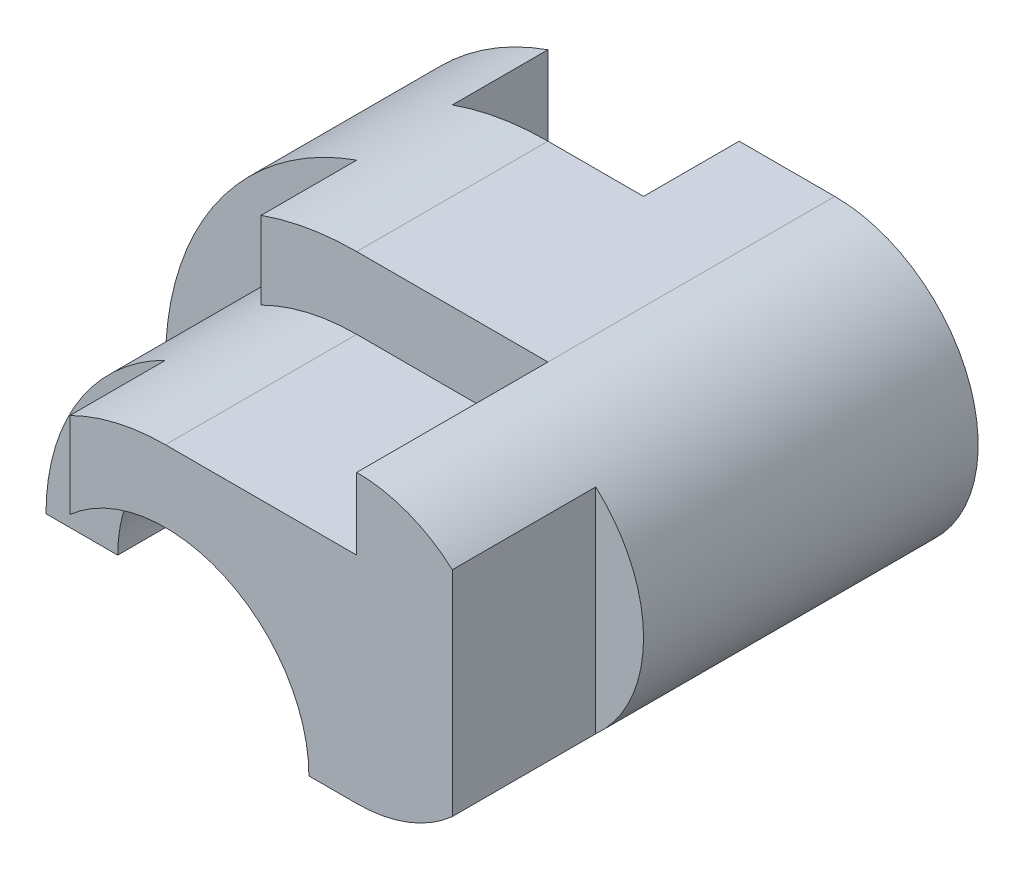
ISO-10303-21;
HEADER;
FILE_DESCRIPTION(('STEP AP214'),'2;1');
FILE_NAME('part.step','',(''),(''),'','','');
FILE_SCHEMA(('AUTOMOTIVE_DESIGN { 1 0 10303 214 1 1 1 1 }'));
ENDSEC;
DATA;
#1=APPLICATION_CONTEXT('core data for automotive mechanical design processes');
#2=APPLICATION_PROTOCOL_DEFINITION('international standard','automotive_design',2000,#1);
#3=PRODUCT_CONTEXT('',#1,'mechanical');
#4=PRODUCT('Part','Part','',(#3));
#5=PRODUCT_RELATED_PRODUCT_CATEGORY('part','',(#4));
#6=PRODUCT_DEFINITION_FORMATION('','',#4);
#7=PRODUCT_DEFINITION_CONTEXT('part definition',#1,'design');
#8=PRODUCT_DEFINITION('design','',#6,#7);
#9=PRODUCT_DEFINITION_SHAPE('','',#8);
#10=(LENGTH_UNIT() NAMED_UNIT(*) SI_UNIT(.MILLI.,.METRE.));
#11=(NAMED_UNIT(*) PLANE_ANGLE_UNIT() SI_UNIT($,.RADIAN.));
#12=(NAMED_UNIT(*) SI_UNIT($,.STERADIAN.) SOLID_ANGLE_UNIT());
#13=UNCERTAINTY_MEASURE_WITH_UNIT(LENGTH_MEASURE(1.E-05),#10,'distance_accuracy_value','');
#14=(GEOMETRIC_REPRESENTATION_CONTEXT(3) GLOBAL_UNCERTAINTY_ASSIGNED_CONTEXT((#13)) GLOBAL_UNIT_ASSIGNED_CONTEXT((#10,
#11,#12)) REPRESENTATION_CONTEXT('',''));
#15=CARTESIAN_POINT('',(0.,0.,0.));
#16=DIRECTION('',(0.,0.,1.));
#17=DIRECTION('',(1.,0.,0.));
#18=AXIS2_PLACEMENT_3D('',#15,#16,#17);
#19=CARTESIAN_POINT('',(20.,-61.999,20.));
#20=DIRECTION('',(0.,0.,1.));
#21=DIRECTION('',(1.,0.,0.));
#22=AXIS2_PLACEMENT_3D('',#19,#20,#21);
#23=PLANE('',#22);
#24=CARTESIAN_POINT('',(0.,0.,20.));
#25=DIRECTION('',(0.,0.,1.));
#26=DIRECTION('',(1.,0.,0.));
#27=AXIS2_PLACEMENT_3D('',#24,#25,#26);
#28=CIRCLE('',#27,30.);
#29=CARTESIAN_POINT('',(20.,22.3606797749979,20.));
#30=VERTEX_POINT('',#29);
#31=CARTESIAN_POINT('',(-20.,22.3606797749979,20.));
#32=VERTEX_POINT('',#31);
#33=EDGE_CURVE('E11',#30,#32,#28,.T.);
#34=ORIENTED_EDGE('',*,*,#33,.T.);
#35=DIRECTION('',(0.,1.,0.));
#36=VECTOR('',#35,1.);
#37=CARTESIAN_POINT('',(-20.,-61.999,20.));
#38=LINE('',#37,#36);
#39=CARTESIAN_POINT('',(-20.,56.5685424949238,20.));
#40=VERTEX_POINT('',#39);
#41=EDGE_CURVE('E171',#32,#40,#38,.T.);
#42=ORIENTED_EDGE('',*,*,#41,.T.);
#43=CARTESIAN_POINT('',(0.,0.,20.));
#44=DIRECTION('',(0.,0.,1.));
#45=DIRECTION('',(1.,0.,0.));
#46=AXIS2_PLACEMENT_3D('',#43,#44,#45);
#47=CIRCLE('',#46,60.);
#48=CARTESIAN_POINT('',(0.,60.,20.));
#49=VERTEX_POINT('',#48);
#50=EDGE_CURVE('E198',#40,#49,#47,.F.);
#51=ORIENTED_EDGE('',*,*,#50,.T.);
#52=DIRECTION('',(1.,0.,0.));
#53=VECTOR('',#52,1.);
#54=CARTESIAN_POINT('',(20.,60.,20.));
#55=LINE('',#54,#53);
#56=CARTESIAN_POINT('',(20.,60.,20.));
#57=VERTEX_POINT('',#56);
#58=EDGE_CURVE('E181',#49,#57,#55,.T.);
#59=ORIENTED_EDGE('',*,*,#58,.T.);
#60=DIRECTION('',(0.,1.,0.));
#61=VECTOR('',#60,1.);
#62=CARTESIAN_POINT('',(20.,-61.999,20.));
#63=LINE('',#62,#61);
#64=EDGE_CURVE('E180',#30,#57,#63,.T.);
#65=ORIENTED_EDGE('',*,*,#64,.F.);
#66=EDGE_LOOP('',(#34,#42,#51,#59,#65));
#67=FACE_BOUND('',#66,.T.);
#68=ADVANCED_FACE('F35',(#67),#23,.F.);
#69=CARTESIAN_POINT('',(0.,0.,0.));
#70=DIRECTION('',(0.,0.,1.));
#71=DIRECTION('',(1.,0.,0.));
#72=AXIS2_PLACEMENT_3D('',#69,#70,#71);
#73=PLANE('',#72);
#74=DIRECTION('',(0.,-1.,0.));
#75=VECTOR('',#74,1.);
#76=CARTESIAN_POINT('',(-20.,0.,0.));
#77=LINE('',#76,#75);
#78=CARTESIAN_POINT('',(-20.,56.5685424949238,0.));
#79=VERTEX_POINT('',#78);
#80=CARTESIAN_POINT('',(-20.,22.3606797749979,0.));
#81=VERTEX_POINT('',#80);
#82=EDGE_CURVE('E295',#79,#81,#77,.T.);
#83=ORIENTED_EDGE('',*,*,#82,.T.);
#84=CARTESIAN_POINT('',(0.,0.,0.));
#85=DIRECTION('',(0.,0.,1.));
#86=DIRECTION('',(1.,0.,0.));
#87=AXIS2_PLACEMENT_3D('',#84,#85,#86);
#88=CIRCLE('',#87,30.);
#89=CARTESIAN_POINT('',(-30.,0.,0.));
#90=VERTEX_POINT('',#89);
#91=EDGE_CURVE('E191',#81,#90,#88,.T.);
#92=ORIENTED_EDGE('',*,*,#91,.T.);
#93=DIRECTION('',(1.,0.,0.));
#94=VECTOR('',#93,1.);
#95=CARTESIAN_POINT('',(0.,0.,0.));
#96=LINE('',#95,#94);
#97=CARTESIAN_POINT('',(-60.,0.,0.));
#98=VERTEX_POINT('',#97);
#99=EDGE_CURVE('E263',#98,#90,#96,.T.);
#100=ORIENTED_EDGE('',*,*,#99,.F.);
#101=CARTESIAN_POINT('',(0.,0.,0.));
#102=DIRECTION('',(0.,0.,1.));
#103=DIRECTION('',(1.,0.,0.));
#104=AXIS2_PLACEMENT_3D('',#101,#102,#103);
#105=CIRCLE('',#104,60.);
#106=EDGE_CURVE('E248',#98,#79,#105,.F.);
#107=ORIENTED_EDGE('',*,*,#106,.T.);
#108=EDGE_LOOP('',(#83,#92,#100,#107));
#109=FACE_BOUND('',#108,.T.);
#110=ADVANCED_FACE('F378',(#109),#73,.F.);
#111=CARTESIAN_POINT('',(-20.,-61.999,0.));
#112=DIRECTION('',(-1.,0.,0.));
#113=DIRECTION('',(0.,0.,1.));
#114=AXIS2_PLACEMENT_3D('',#111,#112,#113);
#115=PLANE('',#114);
#116=ORIENTED_EDGE('',*,*,#41,.F.);
#117=DIRECTION('',(0.,0.,-1.));
#118=VECTOR('',#117,1.);
#119=CARTESIAN_POINT('',(-20.,22.3606797749979,100.));
#120=LINE('',#119,#118);
#121=EDGE_CURVE('E174',#32,#81,#120,.T.);
#122=ORIENTED_EDGE('',*,*,#121,.T.);
#123=ORIENTED_EDGE('',*,*,#82,.F.);
#124=DIRECTION('',(0.,0.,-1.));
#125=VECTOR('',#124,1.);
#126=CARTESIAN_POINT('',(-20.,56.5685424949238,100.));
#127=LINE('',#126,#125);
#128=EDGE_CURVE('E176',#79,#40,#127,.F.);
#129=ORIENTED_EDGE('',*,*,#128,.T.);
#130=EDGE_LOOP('',(#116,#122,#123,#129));
#131=FACE_BOUND('',#130,.T.);
#132=ADVANCED_FACE('F172',(#131),#115,.F.);
#133=CARTESIAN_POINT('',(30.,0.,0.));
#134=VERTEX_POINT('',#133);
#135=CARTESIAN_POINT('',(20.,22.3606797749979,0.));
#136=VERTEX_POINT('',#135);
#137=EDGE_CURVE('E266',#134,#136,#88,.T.);
#138=ORIENTED_EDGE('',*,*,#137,.T.);
#139=DIRECTION('',(0.,1.,0.));
#140=VECTOR('',#139,1.);
#141=CARTESIAN_POINT('',(20.,0.,0.));
#142=LINE('',#141,#140);
#143=CARTESIAN_POINT('',(20.,60.,0.));
#144=VERTEX_POINT('',#143);
#145=EDGE_CURVE('E43',#136,#144,#142,.T.);
#146=ORIENTED_EDGE('',*,*,#145,.T.);
#147=DIRECTION('',(1.,0.,0.));
#148=VECTOR('',#147,1.);
#149=CARTESIAN_POINT('',(0.,60.,0.));
#150=LINE('',#149,#148);
#151=CARTESIAN_POINT('',(40.,60.,0.));
#152=VERTEX_POINT('',#151);
#153=EDGE_CURVE('E253',#144,#152,#150,.T.);
#154=ORIENTED_EDGE('',*,*,#153,.T.);
#155=CARTESIAN_POINT('',(40.,30.,0.));
#156=DIRECTION('',(0.,0.,1.));
#157=DIRECTION('',(1.,0.,0.));
#158=AXIS2_PLACEMENT_3D('',#155,#156,#157);
#159=CIRCLE('',#158,30.);
#160=CARTESIAN_POINT('',(40.,0.,0.));
#161=VERTEX_POINT('',#160);
#162=EDGE_CURVE('E272',#152,#161,#159,.F.);
#163=ORIENTED_EDGE('',*,*,#162,.T.);
#164=DIRECTION('',(-1.,0.,0.));
#165=VECTOR('',#164,1.);
#166=CARTESIAN_POINT('',(0.,0.,0.));
#167=LINE('',#166,#165);
#168=EDGE_CURVE('E269',#161,#134,#167,.T.);
#169=ORIENTED_EDGE('',*,*,#168,.T.);
#170=EDGE_LOOP('',(#138,#146,#154,#163,#169));
#171=FACE_BOUND('',#170,.T.);
#172=ADVANCED_FACE('F299',(#171),#73,.F.);
#173=CARTESIAN_POINT('',(0.,0.,100.));
#174=DIRECTION('',(0.,0.,-1.));
#175=DIRECTION('',(-1.,0.,0.));
#176=AXIS2_PLACEMENT_3D('',#173,#174,#175);
#177=CYLINDRICAL_SURFACE('',#176,60.);
#178=CARTESIAN_POINT('',(0.,0.,40.));
#179=DIRECTION('',(0.,0.,1.));
#180=DIRECTION('',(1.,0.,0.));
#181=AXIS2_PLACEMENT_3D('',#178,#179,#180);
#182=CIRCLE('',#181,60.);
#183=CARTESIAN_POINT('',(-60.,0.,40.));
#184=VERTEX_POINT('',#183);
#185=CARTESIAN_POINT('',(-20.,56.5685424949238,40.));
#186=VERTEX_POINT('',#185);
#187=EDGE_CURVE('E238',#184,#186,#182,.F.);
#188=ORIENTED_EDGE('',*,*,#187,.T.);
#189=DIRECTION('',(0.,0.,1.));
#190=VECTOR('',#189,1.);
#191=CARTESIAN_POINT('',(-20.,56.5685424949238,31.001));
#192=LINE('',#191,#190);
#193=CARTESIAN_POINT('',(-20.,56.5685424949238,60.));
#194=VERTEX_POINT('',#193);
#195=EDGE_CURVE('E330',#186,#194,#192,.T.);
#196=ORIENTED_EDGE('',*,*,#195,.T.);
#197=CARTESIAN_POINT('',(0.,0.,60.));
#198=DIRECTION('',(0.,0.,1.));
#199=DIRECTION('',(1.,0.,0.));
#200=AXIS2_PLACEMENT_3D('',#197,#198,#199);
#201=CIRCLE('',#200,60.);
#202=CARTESIAN_POINT('',(0.,60.,60.));
#203=VERTEX_POINT('',#202);
#204=EDGE_CURVE('E336',#203,#194,#201,.T.);
#205=ORIENTED_EDGE('',*,*,#204,.F.);
#206=DIRECTION('',(0.,0.,-1.));
#207=VECTOR('',#206,1.);
#208=CARTESIAN_POINT('',(0.,60.,100.));
#209=LINE('',#208,#207);
#210=EDGE_CURVE('E260',#203,#49,#209,.T.);
#211=ORIENTED_EDGE('',*,*,#210,.T.);
#212=ORIENTED_EDGE('',*,*,#50,.F.);
#213=ORIENTED_EDGE('',*,*,#128,.F.);
#214=ORIENTED_EDGE('',*,*,#106,.F.);
#215=DIRECTION('',(0.,0.,-1.));
#216=VECTOR('',#215,1.);
#217=CARTESIAN_POINT('',(-60.,0.,100.));
#218=LINE('',#217,#216);
#219=EDGE_CURVE('E286',#184,#98,#218,.T.);
#220=ORIENTED_EDGE('',*,*,#219,.F.);
#221=EDGE_LOOP('',(#188,#196,#205,#211,#212,#213,#214,#220));
#222=FACE_BOUND('',#221,.T.);
#223=ADVANCED_FACE('F37',(#222),#177,.T.);
#224=CARTESIAN_POINT('',(-20.,100.,80.));
#225=DIRECTION('',(0.,0.,-1.));
#226=DIRECTION('',(-1.,0.,0.));
#227=AXIS2_PLACEMENT_3D('',#224,#225,#226);
#228=PLANE('',#227);
#229=CARTESIAN_POINT('',(0.,0.,80.));
#230=DIRECTION('',(0.,0.,1.));
#231=DIRECTION('',(1.,0.,0.));
#232=AXIS2_PLACEMENT_3D('',#229,#230,#231);
#233=CIRCLE('',#232,45.);
#234=CARTESIAN_POINT('',(-20.,40.3112887414928,80.));
#235=VERTEX_POINT('',#234);
#236=CARTESIAN_POINT('',(-45.,0.,80.));
#237=VERTEX_POINT('',#236);
#238=EDGE_CURVE('E200',#235,#237,#233,.T.);
#239=ORIENTED_EDGE('',*,*,#238,.T.);
#240=DIRECTION('',(1.,0.,0.));
#241=VECTOR('',#240,1.);
#242=CARTESIAN_POINT('',(-20.,0.,80.));
#243=LINE('',#242,#241);
#244=CARTESIAN_POINT('',(-30.,0.,80.));
#245=VERTEX_POINT('',#244);
#246=EDGE_CURVE('E225',#237,#245,#243,.T.);
#247=ORIENTED_EDGE('',*,*,#246,.T.);
#248=CARTESIAN_POINT('',(0.,0.,80.));
#249=DIRECTION('',(0.,0.,-1.));
#250=DIRECTION('',(-1.,0.,0.));
#251=AXIS2_PLACEMENT_3D('',#248,#249,#250);
#252=CIRCLE('',#251,30.);
#253=CARTESIAN_POINT('',(-20.,22.3606797749979,80.));
#254=VERTEX_POINT('',#253);
#255=EDGE_CURVE('E233',#245,#254,#252,.T.);
#256=ORIENTED_EDGE('',*,*,#255,.T.);
#257=DIRECTION('',(0.,-1.,0.));
#258=VECTOR('',#257,1.);
#259=CARTESIAN_POINT('',(-20.,100.,80.));
#260=LINE('',#259,#258);
#261=EDGE_CURVE('E231',#235,#254,#260,.T.);
#262=ORIENTED_EDGE('',*,*,#261,.F.);
#263=EDGE_LOOP('',(#239,#247,#256,#262));
#264=FACE_BOUND('',#263,.T.);
#265=ADVANCED_FACE('F394',(#264),#228,.F.);
#266=CARTESIAN_POINT('',(0.,0.,60.));
#267=DIRECTION('',(0.,0.,1.));
#268=DIRECTION('',(1.,0.,0.));
#269=AXIS2_PLACEMENT_3D('',#266,#267,#268);
#270=PLANE('',#269);
#271=DIRECTION('',(-1.,0.,0.));
#272=VECTOR('',#271,1.);
#273=CARTESIAN_POINT('',(0.,60.,60.));
#274=LINE('',#273,#272);
#275=CARTESIAN_POINT('',(40.,60.,60.));
#276=VERTEX_POINT('',#275);
#277=EDGE_CURVE('E212',#276,#203,#274,.T.);
#278=ORIENTED_EDGE('',*,*,#277,.T.);
#279=ORIENTED_EDGE('',*,*,#204,.T.);
#280=DIRECTION('',(0.,-1.,0.));
#281=VECTOR('',#280,1.);
#282=CARTESIAN_POINT('',(-20.,40.3112887414928,60.));
#283=LINE('',#282,#281);
#284=CARTESIAN_POINT('',(-20.,40.3112887414928,60.));
#285=VERTEX_POINT('',#284);
#286=EDGE_CURVE('E332',#194,#285,#283,.T.);
#287=ORIENTED_EDGE('',*,*,#286,.T.);
#288=CARTESIAN_POINT('',(0.,0.,60.));
#289=DIRECTION('',(0.,0.,-1.));
#290=DIRECTION('',(1.,0.,0.));
#291=AXIS2_PLACEMENT_3D('',#288,#289,#290);
#292=CIRCLE('',#291,45.);
#293=CARTESIAN_POINT('',(0.,45.,60.));
#294=VERTEX_POINT('',#293);
#295=EDGE_CURVE('E339',#285,#294,#292,.T.);
#296=ORIENTED_EDGE('',*,*,#295,.T.);
#297=DIRECTION('',(-1.,0.,0.));
#298=VECTOR('',#297,1.);
#299=CARTESIAN_POINT('',(0.,45.,60.));
#300=LINE('',#299,#298);
#301=CARTESIAN_POINT('',(40.,45.,60.));
#302=VERTEX_POINT('',#301);
#303=EDGE_CURVE('E206',#302,#294,#300,.T.);
#304=ORIENTED_EDGE('',*,*,#303,.F.);
#305=DIRECTION('',(0.,-1.,0.));
#306=VECTOR('',#305,1.);
#307=CARTESIAN_POINT('',(40.0000000000003,2.77555756156291E-13,60.));
#308=LINE('',#307,#306);
#309=EDGE_CURVE('E209',#276,#302,#308,.T.);
#310=ORIENTED_EDGE('',*,*,#309,.F.);
#311=EDGE_LOOP('',(#278,#279,#287,#296,#304,#310));
#312=FACE_BOUND('',#311,.T.);
#313=ADVANCED_FACE('F343',(#312),#270,.T.);
#314=CARTESIAN_POINT('',(0.,0.,100.));
#315=DIRECTION('',(0.,0.,1.));
#316=DIRECTION('',(1.,0.,0.));
#317=AXIS2_PLACEMENT_3D('',#314,#315,#316);
#318=PLANE('',#317);
#319=DIRECTION('',(-1.,0.,0.));
#320=VECTOR('',#319,1.);
#321=CARTESIAN_POINT('',(0.,45.,100.));
#322=LINE('',#321,#320);
#323=CARTESIAN_POINT('',(40.,45.,100.));
#324=VERTEX_POINT('',#323);
#325=CARTESIAN_POINT('',(0.,45.,100.));
#326=VERTEX_POINT('',#325);
#327=EDGE_CURVE('E218',#324,#326,#322,.T.);
#328=ORIENTED_EDGE('',*,*,#327,.T.);
#329=CARTESIAN_POINT('',(0.,0.,100.));
#330=DIRECTION('',(0.,0.,1.));
#331=DIRECTION('',(1.,0.,0.));
#332=AXIS2_PLACEMENT_3D('',#329,#330,#331);
#333=CIRCLE('',#332,45.);
#334=CARTESIAN_POINT('',(-20.,40.3112887414927,100.));
#335=VERTEX_POINT('',#334);
#336=EDGE_CURVE('E203',#326,#335,#333,.T.);
#337=ORIENTED_EDGE('',*,*,#336,.T.);
#338=DIRECTION('',(0.,-1.,0.));
#339=VECTOR('',#338,1.);
#340=CARTESIAN_POINT('',(-20.,100.,100.));
#341=LINE('',#340,#339);
#342=CARTESIAN_POINT('',(-20.,22.3606797749979,100.));
#343=VERTEX_POINT('',#342);
#344=EDGE_CURVE('E230',#335,#343,#341,.T.);
#345=ORIENTED_EDGE('',*,*,#344,.T.);
#346=CARTESIAN_POINT('',(0.,0.,100.));
#347=DIRECTION('',(0.,0.,1.));
#348=DIRECTION('',(1.,0.,0.));
#349=AXIS2_PLACEMENT_3D('',#346,#347,#348);
#350=CIRCLE('',#349,30.);
#351=CARTESIAN_POINT('',(30.,0.,100.));
#352=VERTEX_POINT('',#351);
#353=EDGE_CURVE('E249',#352,#343,#350,.T.);
#354=ORIENTED_EDGE('',*,*,#353,.F.);
#355=DIRECTION('',(-1.,0.,0.));
#356=VECTOR('',#355,1.);
#357=CARTESIAN_POINT('',(0.,0.,100.));
#358=LINE('',#357,#356);
#359=CARTESIAN_POINT('',(40.,0.,100.));
#360=VERTEX_POINT('',#359);
#361=EDGE_CURVE('E252',#360,#352,#358,.T.);
#362=ORIENTED_EDGE('',*,*,#361,.F.);
#363=CARTESIAN_POINT('',(40.,30.,100.));
#364=DIRECTION('',(0.,0.,1.));
#365=DIRECTION('',(1.,0.,0.));
#366=AXIS2_PLACEMENT_3D('',#363,#364,#365);
#367=CIRCLE('',#366,30.);
#368=CARTESIAN_POINT('',(60.,7.63932022500211,100.));
#369=VERTEX_POINT('',#368);
#370=EDGE_CURVE('E256',#369,#360,#367,.F.);
#371=ORIENTED_EDGE('',*,*,#370,.F.);
#372=DIRECTION('',(0.,1.,0.));
#373=VECTOR('',#372,1.);
#374=CARTESIAN_POINT('',(60.,0.,100.));
#375=LINE('',#374,#373);
#376=CARTESIAN_POINT('',(60.,52.3606797749979,100.));
#377=VERTEX_POINT('',#376);
#378=EDGE_CURVE('E288',#369,#377,#375,.T.);
#379=ORIENTED_EDGE('',*,*,#378,.T.);
#380=CARTESIAN_POINT('',(40.,60.,100.));
#381=VERTEX_POINT('',#380);
#382=EDGE_CURVE('E257',#381,#377,#367,.F.);
#383=ORIENTED_EDGE('',*,*,#382,.F.);
#384=DIRECTION('',(0.,-1.,0.));
#385=VECTOR('',#384,1.);
#386=CARTESIAN_POINT('',(40.0000000000003,2.77555756156291E-13,100.));
#387=LINE('',#386,#385);
#388=EDGE_CURVE('E210',#381,#324,#387,.T.);
#389=ORIENTED_EDGE('',*,*,#388,.T.);
#390=EDGE_LOOP('',(#328,#337,#345,#354,#362,#371,#379,#383,#389));
#391=FACE_BOUND('',#390,.T.);
#392=ADVANCED_FACE('F358',(#391),#318,.T.);
#393=CARTESIAN_POINT('',(0.,60.,100.));
#394=DIRECTION('',(0.,1.,0.));
#395=DIRECTION('',(0.,0.,1.));
#396=AXIS2_PLACEMENT_3D('',#393,#394,#395);
#397=PLANE('',#396);
#398=DIRECTION('',(0.,0.,-1.));
#399=VECTOR('',#398,1.);
#400=CARTESIAN_POINT('',(20.,60.,0.));
#401=LINE('',#400,#399);
#402=EDGE_CURVE('E307',#57,#144,#401,.T.);
#403=ORIENTED_EDGE('',*,*,#402,.F.);
#404=ORIENTED_EDGE('',*,*,#58,.F.);
#405=ORIENTED_EDGE('',*,*,#210,.F.);
#406=ORIENTED_EDGE('',*,*,#277,.F.);
#407=DIRECTION('',(0.,0.,-1.));
#408=VECTOR('',#407,1.);
#409=CARTESIAN_POINT('',(40.,60.,100.));
#410=LINE('',#409,#408);
#411=EDGE_CURVE('E277',#276,#152,#410,.T.);
#412=ORIENTED_EDGE('',*,*,#411,.T.);
#413=ORIENTED_EDGE('',*,*,#153,.F.);
#414=EDGE_LOOP('',(#403,#404,#405,#406,#412,#413));
#415=FACE_BOUND('',#414,.T.);
#416=ADVANCED_FACE('F305',(#415),#397,.T.);
#417=CARTESIAN_POINT('',(-20.,100.,100.));
#418=DIRECTION('',(1.,0.,0.));
#419=DIRECTION('',(0.,0.,-1.));
#420=AXIS2_PLACEMENT_3D('',#417,#418,#419);
#421=PLANE('',#420);
#422=DIRECTION('',(0.,0.,1.));
#423=VECTOR('',#422,1.);
#424=CARTESIAN_POINT('',(-20.,40.3112887414927,60.));
#425=LINE('',#424,#423);
#426=EDGE_CURVE('E223',#235,#335,#425,.T.);
#427=ORIENTED_EDGE('',*,*,#426,.F.);
#428=ORIENTED_EDGE('',*,*,#261,.T.);
#429=DIRECTION('',(0.,0.,-1.));
#430=VECTOR('',#429,1.);
#431=CARTESIAN_POINT('',(-20.,22.3606797749979,100.));
#432=LINE('',#431,#430);
#433=EDGE_CURVE('E292',#254,#343,#432,.F.);
#434=ORIENTED_EDGE('',*,*,#433,.T.);
#435=ORIENTED_EDGE('',*,*,#344,.F.);
#436=EDGE_LOOP('',(#427,#428,#434,#435));
#437=FACE_BOUND('',#436,.T.);
#438=ADVANCED_FACE('F404',(#437),#421,.F.);
#439=CARTESIAN_POINT('',(0.,0.,100.));
#440=DIRECTION('',(0.,1.,0.));
#441=DIRECTION('',(0.,0.,1.));
#442=AXIS2_PLACEMENT_3D('',#439,#440,#441);
#443=PLANE('',#442);
#444=ORIENTED_EDGE('',*,*,#246,.F.);
#445=DIRECTION('',(0.,0.,-1.));
#446=VECTOR('',#445,1.);
#447=CARTESIAN_POINT('',(-45.,-3.19744231092045E-13,68.9989));
#448=LINE('',#447,#446);
#449=CARTESIAN_POINT('',(-45.,0.,40.));
#450=VERTEX_POINT('',#449);
#451=EDGE_CURVE('E323',#237,#450,#448,.T.);
#452=ORIENTED_EDGE('',*,*,#451,.T.);
#453=DIRECTION('',(-1.,0.,0.));
#454=VECTOR('',#453,1.);
#455=CARTESIAN_POINT('',(-60.,0.,40.));
#456=LINE('',#455,#454);
#457=EDGE_CURVE('E50',#450,#184,#456,.T.);
#458=ORIENTED_EDGE('',*,*,#457,.T.);
#459=ORIENTED_EDGE('',*,*,#219,.T.);
#460=ORIENTED_EDGE('',*,*,#99,.T.);
#461=DIRECTION('',(0.,0.,-1.));
#462=VECTOR('',#461,1.);
#463=CARTESIAN_POINT('',(-30.,0.,100.));
#464=LINE('',#463,#462);
#465=EDGE_CURVE('E284',#245,#90,#464,.T.);
#466=ORIENTED_EDGE('',*,*,#465,.F.);
#467=EDGE_LOOP('',(#444,#452,#458,#459,#460,#466));
#468=FACE_BOUND('',#467,.T.);
#469=ADVANCED_FACE('F407',(#468),#443,.F.);
#470=CARTESIAN_POINT('',(40.,30.,100.));
#471=DIRECTION('',(0.,0.,-1.));
#472=DIRECTION('',(-1.,0.,0.));
#473=AXIS2_PLACEMENT_3D('',#470,#471,#472);
#474=CYLINDRICAL_SURFACE('',#473,30.);
#475=CARTESIAN_POINT('',(40.,30.,70.));
#476=DIRECTION('',(0.,0.,1.));
#477=DIRECTION('',(1.,0.,0.));
#478=AXIS2_PLACEMENT_3D('',#475,#476,#477);
#479=CIRCLE('',#478,30.);
#480=CARTESIAN_POINT('',(60.,52.3606797749979,70.));
#481=VERTEX_POINT('',#480);
#482=CARTESIAN_POINT('',(60.,7.63932022500211,70.));
#483=VERTEX_POINT('',#482);
#484=EDGE_CURVE('E290',#481,#483,#479,.F.);
#485=ORIENTED_EDGE('',*,*,#484,.T.);
#486=DIRECTION('',(0.,0.,-1.));
#487=VECTOR('',#486,1.);
#488=CARTESIAN_POINT('',(60.,7.63932022500211,100.));
#489=LINE('',#488,#487);
#490=EDGE_CURVE('E245',#483,#369,#489,.F.);
#491=ORIENTED_EDGE('',*,*,#490,.T.);
#492=ORIENTED_EDGE('',*,*,#370,.T.);
#493=DIRECTION('',(0.,0.,-1.));
#494=VECTOR('',#493,1.);
#495=CARTESIAN_POINT('',(40.,0.,100.));
#496=LINE('',#495,#494);
#497=EDGE_CURVE('E280',#360,#161,#496,.T.);
#498=ORIENTED_EDGE('',*,*,#497,.T.);
#499=ORIENTED_EDGE('',*,*,#162,.F.);
#500=ORIENTED_EDGE('',*,*,#411,.F.);
#501=EDGE_CURVE('E278',#381,#276,#410,.T.);
#502=ORIENTED_EDGE('',*,*,#501,.F.);
#503=ORIENTED_EDGE('',*,*,#382,.T.);
#504=DIRECTION('',(0.,0.,-1.));
#505=VECTOR('',#504,1.);
#506=CARTESIAN_POINT('',(60.,52.3606797749979,100.));
#507=LINE('',#506,#505);
#508=EDGE_CURVE('E58',#377,#481,#507,.T.);
#509=ORIENTED_EDGE('',*,*,#508,.T.);
#510=EDGE_LOOP('',(#485,#491,#492,#498,#499,#500,#502,#503,#509));
#511=FACE_BOUND('',#510,.T.);
#512=ADVANCED_FACE('F314',(#511),#474,.T.);
#513=CARTESIAN_POINT('',(0.,0.,100.));
#514=DIRECTION('',(0.,0.,-1.));
#515=DIRECTION('',(-1.,0.,0.));
#516=AXIS2_PLACEMENT_3D('',#513,#514,#515);
#517=CYLINDRICAL_SURFACE('',#516,30.);
#518=DIRECTION('',(0.,0.,-1.));
#519=VECTOR('',#518,1.);
#520=CARTESIAN_POINT('',(20.,22.3606797749979,100.));
#521=LINE('',#520,#519);
#522=EDGE_CURVE('E193',#136,#30,#521,.F.);
#523=ORIENTED_EDGE('',*,*,#522,.F.);
#524=ORIENTED_EDGE('',*,*,#137,.F.);
#525=DIRECTION('',(0.,0.,-1.));
#526=VECTOR('',#525,1.);
#527=CARTESIAN_POINT('',(30.,0.,100.));
#528=LINE('',#527,#526);
#529=EDGE_CURVE('E282',#352,#134,#528,.T.);
#530=ORIENTED_EDGE('',*,*,#529,.F.);
#531=ORIENTED_EDGE('',*,*,#353,.T.);
#532=ORIENTED_EDGE('',*,*,#433,.F.);
#533=ORIENTED_EDGE('',*,*,#255,.F.);
#534=ORIENTED_EDGE('',*,*,#465,.T.);
#535=ORIENTED_EDGE('',*,*,#91,.F.);
#536=ORIENTED_EDGE('',*,*,#121,.F.);
#537=ORIENTED_EDGE('',*,*,#33,.F.);
#538=EDGE_LOOP('',(#523,#524,#530,#531,#532,#533,#534,#535,#536,#537));
#539=FACE_BOUND('',#538,.T.);
#540=ADVANCED_FACE('F189',(#539),#517,.F.);
#541=CARTESIAN_POINT('',(0.,0.,100.));
#542=DIRECTION('',(0.,-1.,0.));
#543=DIRECTION('',(0.,0.,-1.));
#544=AXIS2_PLACEMENT_3D('',#541,#542,#543);
#545=PLANE('',#544);
#546=ORIENTED_EDGE('',*,*,#168,.F.);
#547=ORIENTED_EDGE('',*,*,#497,.F.);
#548=ORIENTED_EDGE('',*,*,#361,.T.);
#549=ORIENTED_EDGE('',*,*,#529,.T.);
#550=EDGE_LOOP('',(#546,#547,#548,#549));
#551=FACE_BOUND('',#550,.T.);
#552=ADVANCED_FACE('F318',(#551),#545,.T.);
#553=CARTESIAN_POINT('',(70.,100.,70.));
#554=DIRECTION('',(0.,0.,1.));
#555=DIRECTION('',(1.,0.,0.));
#556=AXIS2_PLACEMENT_3D('',#553,#554,#555);
#557=PLANE('',#556);
#558=ORIENTED_EDGE('',*,*,#484,.F.);
#559=DIRECTION('',(0.,-1.,0.));
#560=VECTOR('',#559,1.);
#561=CARTESIAN_POINT('',(60.,100.,70.));
#562=LINE('',#561,#560);
#563=EDGE_CURVE('E241',#481,#483,#562,.T.);
#564=ORIENTED_EDGE('',*,*,#563,.T.);
#565=EDGE_LOOP('',(#558,#564));
#566=FACE_BOUND('',#565,.T.);
#567=ADVANCED_FACE('F366',(#566),#557,.T.);
#568=CARTESIAN_POINT('',(60.,100.,100.));
#569=DIRECTION('',(1.,0.,0.));
#570=DIRECTION('',(0.,0.,-1.));
#571=AXIS2_PLACEMENT_3D('',#568,#569,#570);
#572=PLANE('',#571);
#573=ORIENTED_EDGE('',*,*,#563,.F.);
#574=ORIENTED_EDGE('',*,*,#508,.F.);
#575=ORIENTED_EDGE('',*,*,#378,.F.);
#576=ORIENTED_EDGE('',*,*,#490,.F.);
#577=EDGE_LOOP('',(#573,#574,#575,#576));
#578=FACE_BOUND('',#577,.T.);
#579=ADVANCED_FACE('F365',(#578),#572,.T.);
#580=CARTESIAN_POINT('',(-60.,100.,40.));
#581=DIRECTION('',(0.,0.,1.));
#582=DIRECTION('',(1.,0.,0.));
#583=AXIS2_PLACEMENT_3D('',#580,#581,#582);
#584=PLANE('',#583);
#585=DIRECTION('',(0.,-1.,0.));
#586=VECTOR('',#585,1.);
#587=CARTESIAN_POINT('',(-20.,100.,40.));
#588=LINE('',#587,#586);
#589=CARTESIAN_POINT('',(-20.,40.3112887414928,40.));
#590=VERTEX_POINT('',#589);
#591=EDGE_CURVE('E327',#186,#590,#588,.T.);
#592=ORIENTED_EDGE('',*,*,#591,.F.);
#593=ORIENTED_EDGE('',*,*,#187,.F.);
#594=ORIENTED_EDGE('',*,*,#457,.F.);
#595=CARTESIAN_POINT('',(0.,0.,40.));
#596=DIRECTION('',(0.,0.,1.));
#597=DIRECTION('',(1.,0.,0.));
#598=AXIS2_PLACEMENT_3D('',#595,#596,#597);
#599=CIRCLE('',#598,45.);
#600=EDGE_CURVE('E201',#590,#450,#599,.T.);
#601=ORIENTED_EDGE('',*,*,#600,.F.);
#602=EDGE_LOOP('',(#592,#593,#594,#601));
#603=FACE_BOUND('',#602,.T.);
#604=ADVANCED_FACE('F373',(#603),#584,.T.);
#605=CARTESIAN_POINT('',(0.,0.,60.));
#606=DIRECTION('',(0.,0.,1.));
#607=DIRECTION('',(1.,0.,0.));
#608=AXIS2_PLACEMENT_3D('',#605,#606,#607);
#609=CYLINDRICAL_SURFACE('',#608,45.);
#610=DIRECTION('',(0.,0.,1.));
#611=VECTOR('',#610,1.);
#612=CARTESIAN_POINT('',(-20.,40.3112887414928,31.001));
#613=LINE('',#612,#611);
#614=EDGE_CURVE('E329',#590,#285,#613,.T.);
#615=ORIENTED_EDGE('',*,*,#614,.F.);
#616=ORIENTED_EDGE('',*,*,#600,.T.);
#617=ORIENTED_EDGE('',*,*,#451,.F.);
#618=ORIENTED_EDGE('',*,*,#238,.F.);
#619=ORIENTED_EDGE('',*,*,#426,.T.);
#620=ORIENTED_EDGE('',*,*,#336,.F.);
#621=DIRECTION('',(0.,0.,1.));
#622=VECTOR('',#621,1.);
#623=CARTESIAN_POINT('',(0.,45.,60.));
#624=LINE('',#623,#622);
#625=EDGE_CURVE('E215',#294,#326,#624,.T.);
#626=ORIENTED_EDGE('',*,*,#625,.F.);
#627=ORIENTED_EDGE('',*,*,#295,.F.);
#628=EDGE_LOOP('',(#615,#616,#617,#618,#619,#620,#626,#627));
#629=FACE_BOUND('',#628,.T.);
#630=ADVANCED_FACE('F354',(#629),#609,.T.);
#631=CARTESIAN_POINT('',(40.0000000000003,2.77555756156291E-13,60.));
#632=DIRECTION('',(-1.,0.,0.));
#633=DIRECTION('',(0.,-1.,0.));
#634=AXIS2_PLACEMENT_3D('',#631,#632,#633);
#635=PLANE('',#634);
#636=ORIENTED_EDGE('',*,*,#388,.F.);
#637=ORIENTED_EDGE('',*,*,#501,.T.);
#638=ORIENTED_EDGE('',*,*,#309,.T.);
#639=DIRECTION('',(0.,0.,1.));
#640=VECTOR('',#639,1.);
#641=CARTESIAN_POINT('',(40.,45.,60.));
#642=LINE('',#641,#640);
#643=EDGE_CURVE('E226',#302,#324,#642,.T.);
#644=ORIENTED_EDGE('',*,*,#643,.T.);
#645=EDGE_LOOP('',(#636,#637,#638,#644));
#646=FACE_BOUND('',#645,.T.);
#647=ADVANCED_FACE('F361',(#646),#635,.T.);
#648=CARTESIAN_POINT('',(0.,45.,60.));
#649=DIRECTION('',(0.,1.,0.));
#650=DIRECTION('',(-1.,0.,0.));
#651=AXIS2_PLACEMENT_3D('',#648,#649,#650);
#652=PLANE('',#651);
#653=ORIENTED_EDGE('',*,*,#327,.F.);
#654=ORIENTED_EDGE('',*,*,#643,.F.);
#655=ORIENTED_EDGE('',*,*,#303,.T.);
#656=ORIENTED_EDGE('',*,*,#625,.T.);
#657=EDGE_LOOP('',(#653,#654,#655,#656));
#658=FACE_BOUND('',#657,.T.);
#659=ADVANCED_FACE('F352',(#658),#652,.T.);
#660=CARTESIAN_POINT('',(20.,-61.999,0.));
#661=DIRECTION('',(1.,0.,0.));
#662=DIRECTION('',(0.,0.,-1.));
#663=AXIS2_PLACEMENT_3D('',#660,#661,#662);
#664=PLANE('',#663);
#665=ORIENTED_EDGE('',*,*,#522,.T.);
#666=ORIENTED_EDGE('',*,*,#64,.T.);
#667=ORIENTED_EDGE('',*,*,#402,.T.);
#668=ORIENTED_EDGE('',*,*,#145,.F.);
#669=EDGE_LOOP('',(#665,#666,#667,#668));
#670=FACE_BOUND('',#669,.T.);
#671=ADVANCED_FACE('F321',(#670),#664,.F.);
#672=CARTESIAN_POINT('',(-20.,40.3112887414928,31.001));
#673=DIRECTION('',(-1.,0.,0.));
#674=DIRECTION('',(0.,0.,1.));
#675=AXIS2_PLACEMENT_3D('',#672,#673,#674);
#676=PLANE('',#675);
#677=ORIENTED_EDGE('',*,*,#195,.F.);
#678=ORIENTED_EDGE('',*,*,#591,.T.);
#679=ORIENTED_EDGE('',*,*,#614,.T.);
#680=ORIENTED_EDGE('',*,*,#286,.F.);
#681=EDGE_LOOP('',(#677,#678,#679,#680));
#682=FACE_BOUND('',#681,.T.);
#683=ADVANCED_FACE('F387',(#682),#676,.T.);
#684=CLOSED_SHELL('',(#68,#110,#132,#172,#223,#265,#313,#392,#416,#438,#469,#512,#540,#552,#567,
#579,#604,#630,#647,#659,#671,#683));
#685=MANIFOLD_SOLID_BREP('B2',#684);
#686=ADVANCED_BREP_SHAPE_REPRESENTATION('',(#18,#685),#14);
#687=SHAPE_DEFINITION_REPRESENTATION(#9,#686);
ENDSEC;
END-ISO-10303-21;
